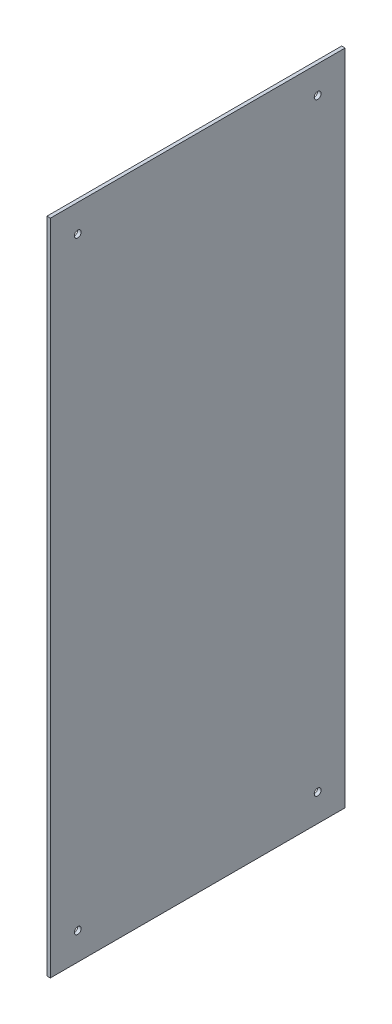
ISO-10303-21;
HEADER;
FILE_DESCRIPTION(('STEP AP214'),'2;1');
FILE_NAME('part.step','',(''),(''),'','','');
FILE_SCHEMA(('AUTOMOTIVE_DESIGN { 1 0 10303 214 1 1 1 1 }'));
ENDSEC;
DATA;
#1=APPLICATION_CONTEXT('core data for automotive mechanical design processes');
#2=APPLICATION_PROTOCOL_DEFINITION('international standard','automotive_design',2000,#1);
#3=PRODUCT_CONTEXT('',#1,'mechanical');
#4=PRODUCT('Part','Part','',(#3));
#5=PRODUCT_RELATED_PRODUCT_CATEGORY('part','',(#4));
#6=PRODUCT_DEFINITION_FORMATION('','',#4);
#7=PRODUCT_DEFINITION_CONTEXT('part definition',#1,'design');
#8=PRODUCT_DEFINITION('design','',#6,#7);
#9=PRODUCT_DEFINITION_SHAPE('','',#8);
#10=(LENGTH_UNIT() NAMED_UNIT(*) SI_UNIT(.MILLI.,.METRE.));
#11=(NAMED_UNIT(*) PLANE_ANGLE_UNIT() SI_UNIT($,.RADIAN.));
#12=(NAMED_UNIT(*) SI_UNIT($,.STERADIAN.) SOLID_ANGLE_UNIT());
#13=UNCERTAINTY_MEASURE_WITH_UNIT(LENGTH_MEASURE(1.E-05),#10,'distance_accuracy_value','');
#14=(GEOMETRIC_REPRESENTATION_CONTEXT(3) GLOBAL_UNCERTAINTY_ASSIGNED_CONTEXT((#13)) GLOBAL_UNIT_ASSIGNED_CONTEXT((#10,
#11,#12)) REPRESENTATION_CONTEXT('',''));
#15=CARTESIAN_POINT('',(0.,0.,0.));
#16=DIRECTION('',(0.,0.,1.));
#17=DIRECTION('',(1.,0.,0.));
#18=AXIS2_PLACEMENT_3D('',#15,#16,#17);
#19=CARTESIAN_POINT('',(3.175,0.,0.));
#20=DIRECTION('',(1.,0.,0.));
#21=DIRECTION('',(0.,0.,-1.));
#22=AXIS2_PLACEMENT_3D('',#19,#20,#21);
#23=PLANE('',#22);
#24=CARTESIAN_POINT('',(3.175,25.4,-247.65));
#25=DIRECTION('',(1.,0.,0.));
#26=DIRECTION('',(0.,0.,-1.));
#27=AXIS2_PLACEMENT_3D('',#24,#25,#26);
#28=CIRCLE('',#27,3.175);
#29=CARTESIAN_POINT('',(3.175,25.4,-250.825));
#30=VERTEX_POINT('',#29);
#31=EDGE_CURVE('E92',#30,#30,#28,.F.);
#32=ORIENTED_EDGE('',*,*,#31,.T.);
#33=EDGE_LOOP('',(#32));
#34=FACE_BOUND('',#33,.T.);
#35=CARTESIAN_POINT('',(3.175,25.4,-25.4));
#36=DIRECTION('',(1.,0.,0.));
#37=DIRECTION('',(0.,0.,-1.));
#38=AXIS2_PLACEMENT_3D('',#35,#36,#37);
#39=CIRCLE('',#38,3.175);
#40=CARTESIAN_POINT('',(3.175,25.4,-28.575));
#41=VERTEX_POINT('',#40);
#42=EDGE_CURVE('E95',#41,#41,#39,.F.);
#43=ORIENTED_EDGE('',*,*,#42,.T.);
#44=EDGE_LOOP('',(#43));
#45=FACE_BOUND('',#44,.T.);
#46=CARTESIAN_POINT('',(3.175,584.2,-25.4));
#47=DIRECTION('',(1.,0.,0.));
#48=DIRECTION('',(0.,0.,-1.));
#49=AXIS2_PLACEMENT_3D('',#46,#47,#48);
#50=CIRCLE('',#49,3.175);
#51=CARTESIAN_POINT('',(3.175,584.2,-28.575));
#52=VERTEX_POINT('',#51);
#53=EDGE_CURVE('E97',#52,#52,#50,.F.);
#54=ORIENTED_EDGE('',*,*,#53,.T.);
#55=EDGE_LOOP('',(#54));
#56=FACE_BOUND('',#55,.T.);
#57=CARTESIAN_POINT('',(3.175,584.2,-247.65));
#58=DIRECTION('',(1.,0.,0.));
#59=DIRECTION('',(0.,0.,-1.));
#60=AXIS2_PLACEMENT_3D('',#57,#58,#59);
#61=CIRCLE('',#60,3.175);
#62=CARTESIAN_POINT('',(3.175,584.2,-250.825));
#63=VERTEX_POINT('',#62);
#64=EDGE_CURVE('E20',#63,#63,#61,.F.);
#65=ORIENTED_EDGE('',*,*,#64,.T.);
#66=EDGE_LOOP('',(#65));
#67=FACE_BOUND('',#66,.T.);
#68=DIRECTION('',(0.,1.,0.));
#69=VECTOR('',#68,1.);
#70=CARTESIAN_POINT('',(3.175,609.6,0.));
#71=LINE('',#70,#69);
#72=CARTESIAN_POINT('',(3.175,0.,0.));
#73=VERTEX_POINT('',#72);
#74=CARTESIAN_POINT('',(3.175,609.6,0.));
#75=VERTEX_POINT('',#74);
#76=EDGE_CURVE('E71',#73,#75,#71,.T.);
#77=ORIENTED_EDGE('',*,*,#76,.F.);
#78=DIRECTION('',(0.,0.,-1.));
#79=VECTOR('',#78,1.);
#80=CARTESIAN_POINT('',(3.175,0.,0.));
#81=LINE('',#80,#79);
#82=CARTESIAN_POINT('',(3.175,0.,-273.05));
#83=VERTEX_POINT('',#82);
#84=EDGE_CURVE('E68',#83,#73,#81,.F.);
#85=ORIENTED_EDGE('',*,*,#84,.F.);
#86=DIRECTION('',(0.,1.,0.));
#87=VECTOR('',#86,1.);
#88=CARTESIAN_POINT('',(3.175,0.,-273.05));
#89=LINE('',#88,#87);
#90=CARTESIAN_POINT('',(3.175,609.6,-273.05));
#91=VERTEX_POINT('',#90);
#92=EDGE_CURVE('E59',#91,#83,#89,.F.);
#93=ORIENTED_EDGE('',*,*,#92,.F.);
#94=DIRECTION('',(0.,0.,1.));
#95=VECTOR('',#94,1.);
#96=CARTESIAN_POINT('',(3.175,609.6,-273.05));
#97=LINE('',#96,#95);
#98=EDGE_CURVE('E54',#75,#91,#97,.F.);
#99=ORIENTED_EDGE('',*,*,#98,.F.);
#100=EDGE_LOOP('',(#77,#85,#93,#99));
#101=FACE_BOUND('',#100,.T.);
#102=ADVANCED_FACE('F17',(#34,#45,#56,#67,#101),#23,.T.);
#103=CARTESIAN_POINT('',(0.,0.,0.));
#104=DIRECTION('',(0.,-1.,0.));
#105=DIRECTION('',(0.,0.,-1.));
#106=AXIS2_PLACEMENT_3D('',#103,#104,#105);
#107=PLANE('',#106);
#108=DIRECTION('',(1.,0.,0.));
#109=VECTOR('',#108,1.);
#110=CARTESIAN_POINT('',(0.,0.,0.));
#111=LINE('',#110,#109);
#112=CARTESIAN_POINT('',(0.,0.,0.));
#113=VERTEX_POINT('',#112);
#114=EDGE_CURVE('E105',#113,#73,#111,.T.);
#115=ORIENTED_EDGE('',*,*,#114,.F.);
#116=DIRECTION('',(0.,0.,-1.));
#117=VECTOR('',#116,1.);
#118=CARTESIAN_POINT('',(0.,0.,0.));
#119=LINE('',#118,#117);
#120=CARTESIAN_POINT('',(0.,0.,-273.05));
#121=VERTEX_POINT('',#120);
#122=EDGE_CURVE('E78',#113,#121,#119,.T.);
#123=ORIENTED_EDGE('',*,*,#122,.T.);
#124=DIRECTION('',(-1.,0.,0.));
#125=VECTOR('',#124,1.);
#126=CARTESIAN_POINT('',(0.,0.,-273.05));
#127=LINE('',#126,#125);
#128=EDGE_CURVE('E64',#83,#121,#127,.T.);
#129=ORIENTED_EDGE('',*,*,#128,.F.);
#130=ORIENTED_EDGE('',*,*,#84,.T.);
#131=EDGE_LOOP('',(#115,#123,#129,#130));
#132=FACE_BOUND('',#131,.T.);
#133=ADVANCED_FACE('F77',(#132),#107,.T.);
#134=CARTESIAN_POINT('',(0.,0.,-273.05));
#135=DIRECTION('',(0.,0.,-1.));
#136=DIRECTION('',(-1.,0.,0.));
#137=AXIS2_PLACEMENT_3D('',#134,#135,#136);
#138=PLANE('',#137);
#139=ORIENTED_EDGE('',*,*,#128,.T.);
#140=DIRECTION('',(0.,1.,0.));
#141=VECTOR('',#140,1.);
#142=CARTESIAN_POINT('',(0.,0.,-273.05));
#143=LINE('',#142,#141);
#144=CARTESIAN_POINT('',(0.,609.6,-273.05));
#145=VERTEX_POINT('',#144);
#146=EDGE_CURVE('E116',#121,#145,#143,.T.);
#147=ORIENTED_EDGE('',*,*,#146,.T.);
#148=DIRECTION('',(1.,0.,0.));
#149=VECTOR('',#148,1.);
#150=CARTESIAN_POINT('',(0.,609.6,-273.05));
#151=LINE('',#150,#149);
#152=EDGE_CURVE('E66',#91,#145,#151,.F.);
#153=ORIENTED_EDGE('',*,*,#152,.F.);
#154=ORIENTED_EDGE('',*,*,#92,.T.);
#155=EDGE_LOOP('',(#139,#147,#153,#154));
#156=FACE_BOUND('',#155,.T.);
#157=ADVANCED_FACE('F61',(#156),#138,.T.);
#158=CARTESIAN_POINT('',(0.,609.6,-273.05));
#159=DIRECTION('',(0.,1.,0.));
#160=DIRECTION('',(0.,0.,1.));
#161=AXIS2_PLACEMENT_3D('',#158,#159,#160);
#162=PLANE('',#161);
#163=ORIENTED_EDGE('',*,*,#152,.T.);
#164=DIRECTION('',(0.,0.,-1.));
#165=VECTOR('',#164,1.);
#166=CARTESIAN_POINT('',(0.,609.6,0.));
#167=LINE('',#166,#165);
#168=CARTESIAN_POINT('',(0.,609.6,0.));
#169=VERTEX_POINT('',#168);
#170=EDGE_CURVE('E113',#145,#169,#167,.F.);
#171=ORIENTED_EDGE('',*,*,#170,.T.);
#172=DIRECTION('',(1.,0.,0.));
#173=VECTOR('',#172,1.);
#174=CARTESIAN_POINT('',(0.,609.6,0.));
#175=LINE('',#174,#173);
#176=EDGE_CURVE('E35',#75,#169,#175,.F.);
#177=ORIENTED_EDGE('',*,*,#176,.F.);
#178=ORIENTED_EDGE('',*,*,#98,.T.);
#179=EDGE_LOOP('',(#163,#171,#177,#178));
#180=FACE_BOUND('',#179,.T.);
#181=ADVANCED_FACE('F112',(#180),#162,.T.);
#182=CARTESIAN_POINT('',(0.,609.6,0.));
#183=DIRECTION('',(0.,0.,1.));
#184=DIRECTION('',(1.,0.,0.));
#185=AXIS2_PLACEMENT_3D('',#182,#183,#184);
#186=PLANE('',#185);
#187=ORIENTED_EDGE('',*,*,#176,.T.);
#188=DIRECTION('',(0.,1.,0.));
#189=VECTOR('',#188,1.);
#190=CARTESIAN_POINT('',(0.,0.,0.));
#191=LINE('',#190,#189);
#192=EDGE_CURVE('E91',#169,#113,#191,.F.);
#193=ORIENTED_EDGE('',*,*,#192,.T.);
#194=ORIENTED_EDGE('',*,*,#114,.T.);
#195=ORIENTED_EDGE('',*,*,#76,.T.);
#196=EDGE_LOOP('',(#187,#193,#194,#195));
#197=FACE_BOUND('',#196,.T.);
#198=ADVANCED_FACE('F119',(#197),#186,.T.);
#199=CARTESIAN_POINT('',(3.175,584.2,-247.65));
#200=DIRECTION('',(1.,0.,0.));
#201=DIRECTION('',(0.,0.,-1.));
#202=AXIS2_PLACEMENT_3D('',#199,#200,#201);
#203=CYLINDRICAL_SURFACE('',#202,3.175);
#204=ORIENTED_EDGE('',*,*,#64,.F.);
#205=EDGE_LOOP('',(#204));
#206=FACE_BOUND('',#205,.T.);
#207=CARTESIAN_POINT('',(0.,584.2,-247.65));
#208=DIRECTION('',(1.,0.,0.));
#209=DIRECTION('',(0.,0.,-1.));
#210=AXIS2_PLACEMENT_3D('',#207,#208,#209);
#211=CIRCLE('',#210,3.175);
#212=CARTESIAN_POINT('',(0.,584.2,-250.825));
#213=VERTEX_POINT('',#212);
#214=EDGE_CURVE('E88',#213,#213,#211,.F.);
#215=ORIENTED_EDGE('',*,*,#214,.T.);
#216=EDGE_LOOP('',(#215));
#217=FACE_BOUND('',#216,.T.);
#218=ADVANCED_FACE('F121',(#206,#217),#203,.F.);
#219=CARTESIAN_POINT('',(3.175,584.2,-25.4));
#220=DIRECTION('',(1.,0.,0.));
#221=DIRECTION('',(0.,0.,-1.));
#222=AXIS2_PLACEMENT_3D('',#219,#220,#221);
#223=CYLINDRICAL_SURFACE('',#222,3.175);
#224=ORIENTED_EDGE('',*,*,#53,.F.);
#225=EDGE_LOOP('',(#224));
#226=FACE_BOUND('',#225,.T.);
#227=CARTESIAN_POINT('',(0.,584.2,-25.4));
#228=DIRECTION('',(1.,0.,0.));
#229=DIRECTION('',(0.,0.,-1.));
#230=AXIS2_PLACEMENT_3D('',#227,#228,#229);
#231=CIRCLE('',#230,3.175);
#232=CARTESIAN_POINT('',(0.,584.2,-28.575));
#233=VERTEX_POINT('',#232);
#234=EDGE_CURVE('E85',#233,#233,#231,.F.);
#235=ORIENTED_EDGE('',*,*,#234,.T.);
#236=EDGE_LOOP('',(#235));
#237=FACE_BOUND('',#236,.T.);
#238=ADVANCED_FACE('F128',(#226,#237),#223,.F.);
#239=CARTESIAN_POINT('',(3.175,25.4,-25.4));
#240=DIRECTION('',(1.,0.,0.));
#241=DIRECTION('',(0.,0.,-1.));
#242=AXIS2_PLACEMENT_3D('',#239,#240,#241);
#243=CYLINDRICAL_SURFACE('',#242,3.175);
#244=ORIENTED_EDGE('',*,*,#42,.F.);
#245=EDGE_LOOP('',(#244));
#246=FACE_BOUND('',#245,.T.);
#247=CARTESIAN_POINT('',(0.,25.4,-25.4));
#248=DIRECTION('',(1.,0.,0.));
#249=DIRECTION('',(0.,0.,-1.));
#250=AXIS2_PLACEMENT_3D('',#247,#248,#249);
#251=CIRCLE('',#250,3.175);
#252=CARTESIAN_POINT('',(0.,25.4,-28.575));
#253=VERTEX_POINT('',#252);
#254=EDGE_CURVE('E26',#253,#253,#251,.F.);
#255=ORIENTED_EDGE('',*,*,#254,.T.);
#256=EDGE_LOOP('',(#255));
#257=FACE_BOUND('',#256,.T.);
#258=ADVANCED_FACE('F139',(#246,#257),#243,.F.);
#259=CARTESIAN_POINT('',(3.175,25.4,-247.65));
#260=DIRECTION('',(1.,0.,0.));
#261=DIRECTION('',(0.,0.,-1.));
#262=AXIS2_PLACEMENT_3D('',#259,#260,#261);
#263=CYLINDRICAL_SURFACE('',#262,3.175);
#264=ORIENTED_EDGE('',*,*,#31,.F.);
#265=EDGE_LOOP('',(#264));
#266=FACE_BOUND('',#265,.T.);
#267=CARTESIAN_POINT('',(0.,25.4,-247.65));
#268=DIRECTION('',(1.,0.,0.));
#269=DIRECTION('',(0.,0.,-1.));
#270=AXIS2_PLACEMENT_3D('',#267,#268,#269);
#271=CIRCLE('',#270,3.175);
#272=CARTESIAN_POINT('',(0.,25.4,-250.825));
#273=VERTEX_POINT('',#272);
#274=EDGE_CURVE('E11',#273,#273,#271,.F.);
#275=ORIENTED_EDGE('',*,*,#274,.T.);
#276=EDGE_LOOP('',(#275));
#277=FACE_BOUND('',#276,.T.);
#278=ADVANCED_FACE('F133',(#266,#277),#263,.F.);
#279=CARTESIAN_POINT('',(0.,0.,0.));
#280=DIRECTION('',(1.,0.,0.));
#281=DIRECTION('',(0.,0.,-1.));
#282=AXIS2_PLACEMENT_3D('',#279,#280,#281);
#283=PLANE('',#282);
#284=ORIENTED_EDGE('',*,*,#274,.F.);
#285=EDGE_LOOP('',(#284));
#286=FACE_BOUND('',#285,.T.);
#287=ORIENTED_EDGE('',*,*,#254,.F.);
#288=EDGE_LOOP('',(#287));
#289=FACE_BOUND('',#288,.T.);
#290=ORIENTED_EDGE('',*,*,#234,.F.);
#291=EDGE_LOOP('',(#290));
#292=FACE_BOUND('',#291,.T.);
#293=ORIENTED_EDGE('',*,*,#214,.F.);
#294=EDGE_LOOP('',(#293));
#295=FACE_BOUND('',#294,.T.);
#296=ORIENTED_EDGE('',*,*,#170,.F.);
#297=ORIENTED_EDGE('',*,*,#146,.F.);
#298=ORIENTED_EDGE('',*,*,#122,.F.);
#299=ORIENTED_EDGE('',*,*,#192,.F.);
#300=EDGE_LOOP('',(#296,#297,#298,#299));
#301=FACE_BOUND('',#300,.T.);
#302=ADVANCED_FACE('F115',(#286,#289,#292,#295,#301),#283,.F.);
#303=CLOSED_SHELL('',(#102,#133,#157,#181,#198,#218,#238,#258,#278,#302));
#304=MANIFOLD_SOLID_BREP('B1',#303);
#305=ADVANCED_BREP_SHAPE_REPRESENTATION('',(#18,#304),#14);
#306=SHAPE_DEFINITION_REPRESENTATION(#9,#305);
ENDSEC;
END-ISO-10303-21;
